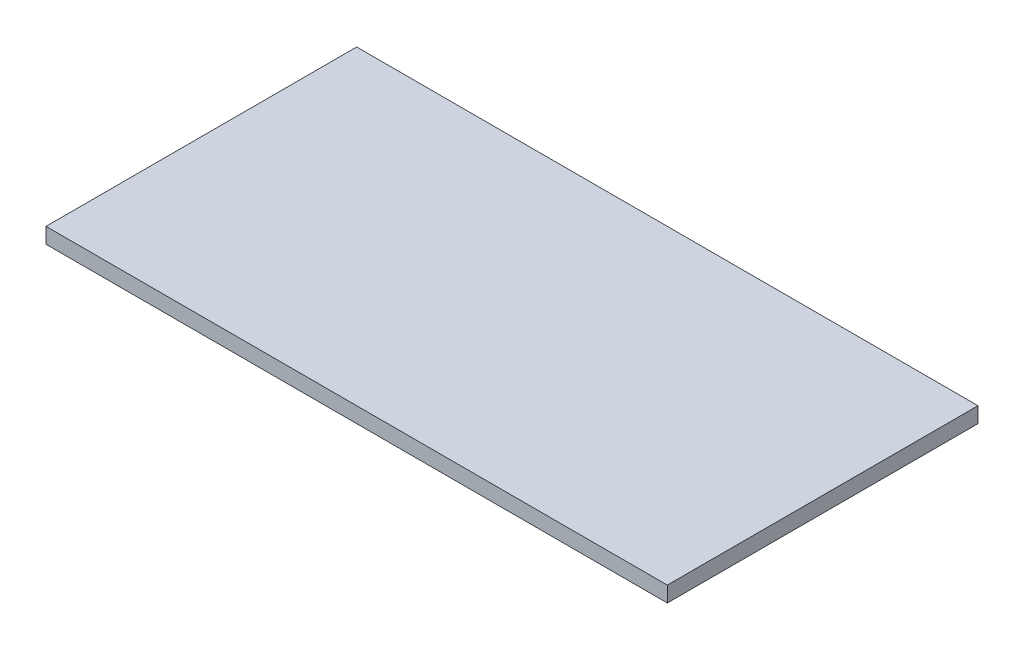
ISO-10303-21;
HEADER;
FILE_DESCRIPTION(('STEP AP214'),'2;1');
FILE_NAME('part.step','',(''),(''),'','','');
FILE_SCHEMA(('AUTOMOTIVE_DESIGN { 1 0 10303 214 1 1 1 1 }'));
ENDSEC;
DATA;
#1=APPLICATION_CONTEXT('core data for automotive mechanical design processes');
#2=APPLICATION_PROTOCOL_DEFINITION('international standard','automotive_design',2000,#1);
#3=PRODUCT_CONTEXT('',#1,'mechanical');
#4=PRODUCT('Part','Part','',(#3));
#5=PRODUCT_RELATED_PRODUCT_CATEGORY('part','',(#4));
#6=PRODUCT_DEFINITION_FORMATION('','',#4);
#7=PRODUCT_DEFINITION_CONTEXT('part definition',#1,'design');
#8=PRODUCT_DEFINITION('design','',#6,#7);
#9=PRODUCT_DEFINITION_SHAPE('','',#8);
#10=(LENGTH_UNIT() NAMED_UNIT(*) SI_UNIT(.MILLI.,.METRE.));
#11=(NAMED_UNIT(*) PLANE_ANGLE_UNIT() SI_UNIT($,.RADIAN.));
#12=(NAMED_UNIT(*) SI_UNIT($,.STERADIAN.) SOLID_ANGLE_UNIT());
#13=UNCERTAINTY_MEASURE_WITH_UNIT(LENGTH_MEASURE(1.E-05),#10,'distance_accuracy_value','');
#14=(GEOMETRIC_REPRESENTATION_CONTEXT(3) GLOBAL_UNCERTAINTY_ASSIGNED_CONTEXT((#13)) GLOBAL_UNIT_ASSIGNED_CONTEXT((#10,
#11,#12)) REPRESENTATION_CONTEXT('',''));
#15=CARTESIAN_POINT('',(0.,0.,0.));
#16=DIRECTION('',(0.,0.,1.));
#17=DIRECTION('',(1.,0.,0.));
#18=AXIS2_PLACEMENT_3D('',#15,#16,#17);
#19=CARTESIAN_POINT('',(100.,5.,50.));
#20=DIRECTION('',(-1.,0.,0.));
#21=DIRECTION('',(0.,0.,1.));
#22=AXIS2_PLACEMENT_3D('',#19,#20,#21);
#23=PLANE('',#22);
#24=DIRECTION('',(0.,0.,-1.));
#25=VECTOR('',#24,1.);
#26=CARTESIAN_POINT('',(100.,0.,50.));
#27=LINE('',#26,#25);
#28=CARTESIAN_POINT('',(100.,0.,50.));
#29=VERTEX_POINT('',#28);
#30=CARTESIAN_POINT('',(100.,0.,-50.));
#31=VERTEX_POINT('',#30);
#32=EDGE_CURVE('E111',#29,#31,#27,.T.);
#33=ORIENTED_EDGE('',*,*,#32,.T.);
#34=DIRECTION('',(0.,-1.,0.));
#35=VECTOR('',#34,1.);
#36=CARTESIAN_POINT('',(100.,5.,-50.));
#37=LINE('',#36,#35);
#38=CARTESIAN_POINT('',(100.,5.,-50.));
#39=VERTEX_POINT('',#38);
#40=EDGE_CURVE('E11',#39,#31,#37,.T.);
#41=ORIENTED_EDGE('',*,*,#40,.F.);
#42=DIRECTION('',(0.,0.,-1.));
#43=VECTOR('',#42,1.);
#44=CARTESIAN_POINT('',(100.,5.,50.));
#45=LINE('',#44,#43);
#46=CARTESIAN_POINT('',(100.,5.,50.));
#47=VERTEX_POINT('',#46);
#48=EDGE_CURVE('E95',#47,#39,#45,.T.);
#49=ORIENTED_EDGE('',*,*,#48,.F.);
#50=DIRECTION('',(0.,-1.,0.));
#51=VECTOR('',#50,1.);
#52=CARTESIAN_POINT('',(100.,5.,50.));
#53=LINE('',#52,#51);
#54=EDGE_CURVE('E107',#47,#29,#53,.T.);
#55=ORIENTED_EDGE('',*,*,#54,.T.);
#56=EDGE_LOOP('',(#33,#41,#49,#55));
#57=FACE_BOUND('',#56,.T.);
#58=ADVANCED_FACE('F43',(#57),#23,.F.);
#59=CARTESIAN_POINT('',(-100.,5.,-50.));
#60=DIRECTION('',(0.,0.,1.));
#61=DIRECTION('',(1.,0.,0.));
#62=AXIS2_PLACEMENT_3D('',#59,#60,#61);
#63=PLANE('',#62);
#64=DIRECTION('',(-1.,0.,0.));
#65=VECTOR('',#64,1.);
#66=CARTESIAN_POINT('',(-100.,0.,-50.));
#67=LINE('',#66,#65);
#68=CARTESIAN_POINT('',(-100.,0.,-50.));
#69=VERTEX_POINT('',#68);
#70=EDGE_CURVE('E100',#31,#69,#67,.T.);
#71=ORIENTED_EDGE('',*,*,#70,.T.);
#72=DIRECTION('',(0.,-1.,0.));
#73=VECTOR('',#72,1.);
#74=CARTESIAN_POINT('',(-100.,5.,-50.));
#75=LINE('',#74,#73);
#76=CARTESIAN_POINT('',(-100.,5.,-50.));
#77=VERTEX_POINT('',#76);
#78=EDGE_CURVE('E52',#77,#69,#75,.T.);
#79=ORIENTED_EDGE('',*,*,#78,.F.);
#80=DIRECTION('',(-1.,0.,0.));
#81=VECTOR('',#80,1.);
#82=CARTESIAN_POINT('',(-100.,5.,-50.));
#83=LINE('',#82,#81);
#84=EDGE_CURVE('E90',#39,#77,#83,.T.);
#85=ORIENTED_EDGE('',*,*,#84,.F.);
#86=ORIENTED_EDGE('',*,*,#40,.T.);
#87=EDGE_LOOP('',(#71,#79,#85,#86));
#88=FACE_BOUND('',#87,.T.);
#89=ADVANCED_FACE('F99',(#88),#63,.F.);
#90=CARTESIAN_POINT('',(-100.,5.,50.));
#91=DIRECTION('',(1.,0.,0.));
#92=DIRECTION('',(0.,0.,-1.));
#93=AXIS2_PLACEMENT_3D('',#90,#91,#92);
#94=PLANE('',#93);
#95=DIRECTION('',(0.,0.,1.));
#96=VECTOR('',#95,1.);
#97=CARTESIAN_POINT('',(-100.,0.,50.));
#98=LINE('',#97,#96);
#99=CARTESIAN_POINT('',(-100.,0.,50.));
#100=VERTEX_POINT('',#99);
#101=EDGE_CURVE('E77',#69,#100,#98,.T.);
#102=ORIENTED_EDGE('',*,*,#101,.T.);
#103=DIRECTION('',(0.,-1.,0.));
#104=VECTOR('',#103,1.);
#105=CARTESIAN_POINT('',(-100.,5.,50.));
#106=LINE('',#105,#104);
#107=CARTESIAN_POINT('',(-100.,5.,50.));
#108=VERTEX_POINT('',#107);
#109=EDGE_CURVE('E102',#108,#100,#106,.T.);
#110=ORIENTED_EDGE('',*,*,#109,.F.);
#111=DIRECTION('',(0.,0.,1.));
#112=VECTOR('',#111,1.);
#113=CARTESIAN_POINT('',(-100.,5.,50.));
#114=LINE('',#113,#112);
#115=EDGE_CURVE('E93',#77,#108,#114,.T.);
#116=ORIENTED_EDGE('',*,*,#115,.F.);
#117=ORIENTED_EDGE('',*,*,#78,.T.);
#118=EDGE_LOOP('',(#102,#110,#116,#117));
#119=FACE_BOUND('',#118,.T.);
#120=ADVANCED_FACE('F103',(#119),#94,.F.);
#121=CARTESIAN_POINT('',(-100.,5.,50.));
#122=DIRECTION('',(0.,0.,-1.));
#123=DIRECTION('',(-1.,0.,0.));
#124=AXIS2_PLACEMENT_3D('',#121,#122,#123);
#125=PLANE('',#124);
#126=DIRECTION('',(1.,0.,0.));
#127=VECTOR('',#126,1.);
#128=CARTESIAN_POINT('',(-100.,0.,50.));
#129=LINE('',#128,#127);
#130=EDGE_CURVE('E83',#100,#29,#129,.T.);
#131=ORIENTED_EDGE('',*,*,#130,.T.);
#132=ORIENTED_EDGE('',*,*,#54,.F.);
#133=DIRECTION('',(1.,0.,0.));
#134=VECTOR('',#133,1.);
#135=CARTESIAN_POINT('',(-100.,5.,50.));
#136=LINE('',#135,#134);
#137=EDGE_CURVE('E60',#108,#47,#136,.T.);
#138=ORIENTED_EDGE('',*,*,#137,.F.);
#139=ORIENTED_EDGE('',*,*,#109,.T.);
#140=EDGE_LOOP('',(#131,#132,#138,#139));
#141=FACE_BOUND('',#140,.T.);
#142=ADVANCED_FACE('F124',(#141),#125,.F.);
#143=CARTESIAN_POINT('',(0.,5.,0.));
#144=DIRECTION('',(0.,-1.,0.));
#145=DIRECTION('',(0.,0.,-1.));
#146=AXIS2_PLACEMENT_3D('',#143,#144,#145);
#147=PLANE('',#146);
#148=ORIENTED_EDGE('',*,*,#48,.T.);
#149=ORIENTED_EDGE('',*,*,#84,.T.);
#150=ORIENTED_EDGE('',*,*,#115,.T.);
#151=ORIENTED_EDGE('',*,*,#137,.T.);
#152=EDGE_LOOP('',(#148,#149,#150,#151));
#153=FACE_BOUND('',#152,.T.);
#154=ADVANCED_FACE('F91',(#153),#147,.F.);
#155=CARTESIAN_POINT('',(0.,0.,0.));
#156=DIRECTION('',(0.,-1.,0.));
#157=DIRECTION('',(0.,0.,-1.));
#158=AXIS2_PLACEMENT_3D('',#155,#156,#157);
#159=PLANE('',#158);
#160=ORIENTED_EDGE('',*,*,#32,.F.);
#161=ORIENTED_EDGE('',*,*,#130,.F.);
#162=ORIENTED_EDGE('',*,*,#101,.F.);
#163=ORIENTED_EDGE('',*,*,#70,.F.);
#164=EDGE_LOOP('',(#160,#161,#162,#163));
#165=FACE_BOUND('',#164,.T.);
#166=ADVANCED_FACE('F127',(#165),#159,.T.);
#167=CLOSED_SHELL('',(#58,#89,#120,#142,#154,#166));
#168=MANIFOLD_SOLID_BREP('B2',#167);
#169=ADVANCED_BREP_SHAPE_REPRESENTATION('',(#18,#168),#14);
#170=SHAPE_DEFINITION_REPRESENTATION(#9,#169);
ENDSEC;
END-ISO-10303-21;
